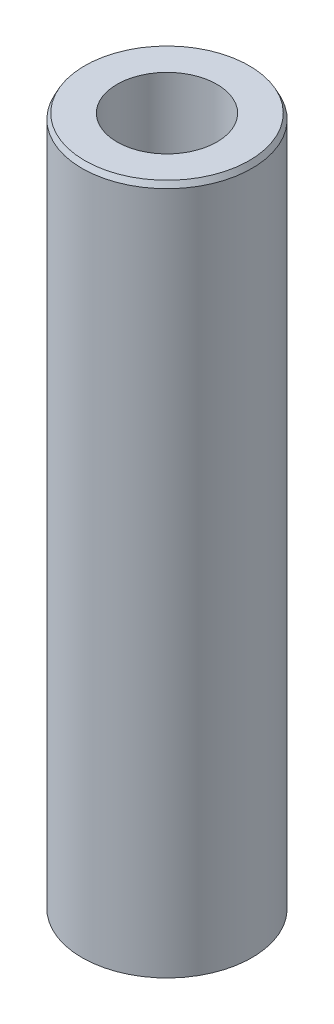
ISO-10303-21;
HEADER;
FILE_DESCRIPTION(('STEP AP214'),'2;1');
FILE_NAME('part.step','',(''),(''),'','','');
FILE_SCHEMA(('AUTOMOTIVE_DESIGN { 1 0 10303 214 1 1 1 1 }'));
ENDSEC;
DATA;
#1=APPLICATION_CONTEXT('core data for automotive mechanical design processes');
#2=APPLICATION_PROTOCOL_DEFINITION('international standard','automotive_design',2000,#1);
#3=PRODUCT_CONTEXT('',#1,'mechanical');
#4=PRODUCT('Part','Part','',(#3));
#5=PRODUCT_RELATED_PRODUCT_CATEGORY('part','',(#4));
#6=PRODUCT_DEFINITION_FORMATION('','',#4);
#7=PRODUCT_DEFINITION_CONTEXT('part definition',#1,'design');
#8=PRODUCT_DEFINITION('design','',#6,#7);
#9=PRODUCT_DEFINITION_SHAPE('','',#8);
#10=(LENGTH_UNIT() NAMED_UNIT(*) SI_UNIT(.MILLI.,.METRE.));
#11=(NAMED_UNIT(*) PLANE_ANGLE_UNIT() SI_UNIT($,.RADIAN.));
#12=(NAMED_UNIT(*) SI_UNIT($,.STERADIAN.) SOLID_ANGLE_UNIT());
#13=UNCERTAINTY_MEASURE_WITH_UNIT(LENGTH_MEASURE(1.E-05),#10,'distance_accuracy_value','');
#14=(GEOMETRIC_REPRESENTATION_CONTEXT(3) GLOBAL_UNCERTAINTY_ASSIGNED_CONTEXT((#13)) GLOBAL_UNIT_ASSIGNED_CONTEXT((#10,
#11,#12)) REPRESENTATION_CONTEXT('',''));
#15=CARTESIAN_POINT('',(0.,0.,0.));
#16=DIRECTION('',(0.,0.,1.));
#17=DIRECTION('',(1.,0.,0.));
#18=AXIS2_PLACEMENT_3D('',#15,#16,#17);
#19=CARTESIAN_POINT('',(0.,386.580082603455,0.));
#20=DIRECTION('',(0.,-1.,0.));
#21=DIRECTION('',(0.,0.,-1.));
#22=AXIS2_PLACEMENT_3D('',#19,#20,#21);
#23=CYLINDRICAL_SURFACE('',#22,47.5);
#24=CARTESIAN_POINT('',(0.,383.578529887456,0.));
#25=DIRECTION('',(0.,1.,0.));
#26=DIRECTION('',(0.,0.,1.));
#27=AXIS2_PLACEMENT_3D('',#24,#25,#26);
#28=CIRCLE('',#27,47.5);
#29=CARTESIAN_POINT('',(0.,383.578529887456,47.5));
#30=VERTEX_POINT('',#29);
#31=EDGE_CURVE('E50',#30,#30,#28,.F.);
#32=ORIENTED_EDGE('',*,*,#31,.T.);
#33=EDGE_LOOP('',(#32));
#34=FACE_BOUND('',#33,.T.);
#35=CARTESIAN_POINT('',(0.,1.53381580982481,0.));
#36=DIRECTION('',(0.,1.,0.));
#37=DIRECTION('',(0.,0.,1.));
#38=AXIS2_PLACEMENT_3D('',#35,#36,#37);
#39=CIRCLE('',#38,47.5);
#40=CARTESIAN_POINT('',(0.,1.53381580982481,47.5));
#41=VERTEX_POINT('',#40);
#42=EDGE_CURVE('E51',#41,#41,#39,.T.);
#43=ORIENTED_EDGE('',*,*,#42,.T.);
#44=EDGE_LOOP('',(#43));
#45=FACE_BOUND('',#44,.T.);
#46=ADVANCED_FACE('F39',(#34,#45),#23,.T.);
#47=CARTESIAN_POINT('',(0.,386.580082603455,0.));
#48=DIRECTION('',(0.,1.,0.));
#49=DIRECTION('',(0.,0.,1.));
#50=AXIS2_PLACEMENT_3D('',#47,#48,#49);
#51=PLANE('',#50);
#52=CARTESIAN_POINT('',(0.,386.580082603455,0.));
#53=DIRECTION('',(0.,1.,0.));
#54=DIRECTION('',(0.,0.,1.));
#55=AXIS2_PLACEMENT_3D('',#52,#53,#54);
#56=CIRCLE('',#55,45.9661841901752);
#57=CARTESIAN_POINT('',(0.,386.580082603455,45.9661841901752));
#58=VERTEX_POINT('',#57);
#59=EDGE_CURVE('E54',#58,#58,#56,.T.);
#60=ORIENTED_EDGE('',*,*,#59,.T.);
#61=EDGE_LOOP('',(#60));
#62=FACE_BOUND('',#61,.T.);
#63=CARTESIAN_POINT('',(0.,386.580082603455,0.));
#64=DIRECTION('',(0.,1.,0.));
#65=DIRECTION('',(0.,0.,1.));
#66=AXIS2_PLACEMENT_3D('',#63,#64,#65);
#67=CIRCLE('',#66,27.9351585640363);
#68=CARTESIAN_POINT('',(0.,386.580082603455,27.9351585640363));
#69=VERTEX_POINT('',#68);
#70=EDGE_CURVE('E58',#69,#69,#67,.T.);
#71=ORIENTED_EDGE('',*,*,#70,.F.);
#72=EDGE_LOOP('',(#71));
#73=FACE_BOUND('',#72,.T.);
#74=ADVANCED_FACE('F69',(#62,#73),#51,.T.);
#75=CARTESIAN_POINT('',(0.,0.,0.));
#76=DIRECTION('',(0.,1.,0.));
#77=DIRECTION('',(0.,0.,1.));
#78=AXIS2_PLACEMENT_3D('',#75,#76,#77);
#79=PLANE('',#78);
#80=CARTESIAN_POINT('',(0.,0.,0.));
#81=DIRECTION('',(0.,1.,0.));
#82=DIRECTION('',(0.,0.,1.));
#83=AXIS2_PLACEMENT_3D('',#80,#81,#82);
#84=CIRCLE('',#83,44.4984472840008);
#85=CARTESIAN_POINT('',(0.,0.,44.4984472840008));
#86=VERTEX_POINT('',#85);
#87=EDGE_CURVE('E10',#86,#86,#84,.F.);
#88=ORIENTED_EDGE('',*,*,#87,.T.);
#89=EDGE_LOOP('',(#88));
#90=FACE_BOUND('',#89,.T.);
#91=CARTESIAN_POINT('',(0.,0.,0.));
#92=DIRECTION('',(0.,1.,0.));
#93=DIRECTION('',(0.,0.,1.));
#94=AXIS2_PLACEMENT_3D('',#91,#92,#93);
#95=CIRCLE('',#94,27.9351585640363);
#96=CARTESIAN_POINT('',(0.,0.,27.9351585640363));
#97=VERTEX_POINT('',#96);
#98=EDGE_CURVE('E63',#97,#97,#95,.T.);
#99=ORIENTED_EDGE('',*,*,#98,.T.);
#100=EDGE_LOOP('',(#99));
#101=FACE_BOUND('',#100,.T.);
#102=ADVANCED_FACE('F75',(#90,#101),#79,.F.);
#103=CARTESIAN_POINT('',(0.,386.580082603455,0.));
#104=DIRECTION('',(0.,-1.,0.));
#105=DIRECTION('',(0.,0.,-1.));
#106=AXIS2_PLACEMENT_3D('',#103,#104,#105);
#107=CYLINDRICAL_SURFACE('',#106,27.9351585640363);
#108=ORIENTED_EDGE('',*,*,#70,.T.);
#109=EDGE_LOOP('',(#108));
#110=FACE_BOUND('',#109,.T.);
#111=ORIENTED_EDGE('',*,*,#98,.F.);
#112=EDGE_LOOP('',(#111));
#113=FACE_BOUND('',#112,.T.);
#114=ADVANCED_FACE('F70',(#110,#113),#107,.F.);
#115=CARTESIAN_POINT('',(0.,386.580082603455,0.));
#116=DIRECTION('',(0.,-1.,0.));
#117=DIRECTION('',(0.,0.,-1.));
#118=AXIS2_PLACEMENT_3D('',#115,#116,#117);
#119=CONICAL_SURFACE('',#118,45.9661841901752,0.472414744615119);
#120=ORIENTED_EDGE('',*,*,#31,.F.);
#121=EDGE_LOOP('',(#120));
#122=FACE_BOUND('',#121,.T.);
#123=ORIENTED_EDGE('',*,*,#59,.F.);
#124=EDGE_LOOP('',(#123));
#125=FACE_BOUND('',#124,.T.);
#126=ADVANCED_FACE('F81',(#122,#125),#119,.T.);
#127=CARTESIAN_POINT('',(0.,1.53381580982481,0.));
#128=DIRECTION('',(0.,1.,0.));
#129=DIRECTION('',(0.,0.,1.));
#130=AXIS2_PLACEMENT_3D('',#127,#128,#129);
#131=CONICAL_SURFACE('',#130,47.5,1.09838158217977);
#132=ORIENTED_EDGE('',*,*,#87,.F.);
#133=EDGE_LOOP('',(#132));
#134=FACE_BOUND('',#133,.T.);
#135=ORIENTED_EDGE('',*,*,#42,.F.);
#136=EDGE_LOOP('',(#135));
#137=FACE_BOUND('',#136,.T.);
#138=ADVANCED_FACE('F45',(#134,#137),#131,.T.);
#139=CLOSED_SHELL('',(#46,#74,#102,#114,#126,#138));
#140=MANIFOLD_SOLID_BREP('B2',#139);
#141=ADVANCED_BREP_SHAPE_REPRESENTATION('',(#18,#140),#14);
#142=SHAPE_DEFINITION_REPRESENTATION(#9,#141);
ENDSEC;
END-ISO-10303-21;
